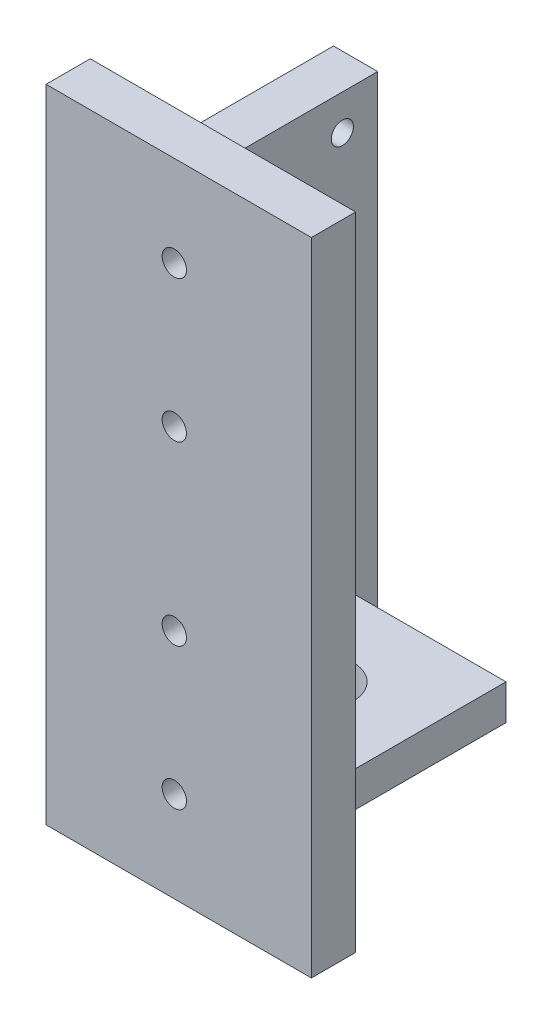
ISO-10303-21;
HEADER;
FILE_DESCRIPTION(('STEP AP214'),'2;1');
FILE_NAME('part.step','',(''),(''),'','','');
FILE_SCHEMA(('AUTOMOTIVE_DESIGN { 1 0 10303 214 1 1 1 1 }'));
ENDSEC;
DATA;
#1=APPLICATION_CONTEXT('core data for automotive mechanical design processes');
#2=APPLICATION_PROTOCOL_DEFINITION('international standard','automotive_design',2000,#1);
#3=PRODUCT_CONTEXT('',#1,'mechanical');
#4=PRODUCT('Part','Part','',(#3));
#5=PRODUCT_RELATED_PRODUCT_CATEGORY('part','',(#4));
#6=PRODUCT_DEFINITION_FORMATION('','',#4);
#7=PRODUCT_DEFINITION_CONTEXT('part definition',#1,'design');
#8=PRODUCT_DEFINITION('design','',#6,#7);
#9=PRODUCT_DEFINITION_SHAPE('','',#8);
#10=(LENGTH_UNIT() NAMED_UNIT(*) SI_UNIT(.MILLI.,.METRE.));
#11=(NAMED_UNIT(*) PLANE_ANGLE_UNIT() SI_UNIT($,.RADIAN.));
#12=(NAMED_UNIT(*) SI_UNIT($,.STERADIAN.) SOLID_ANGLE_UNIT());
#13=UNCERTAINTY_MEASURE_WITH_UNIT(LENGTH_MEASURE(1.E-05),#10,'distance_accuracy_value','');
#14=(GEOMETRIC_REPRESENTATION_CONTEXT(3) GLOBAL_UNCERTAINTY_ASSIGNED_CONTEXT((#13)) GLOBAL_UNIT_ASSIGNED_CONTEXT((#10,
#11,#12)) REPRESENTATION_CONTEXT('',''));
#15=CARTESIAN_POINT('',(0.,0.,0.));
#16=DIRECTION('',(0.,0.,1.));
#17=DIRECTION('',(1.,0.,0.));
#18=AXIS2_PLACEMENT_3D('',#15,#16,#17);
#19=CARTESIAN_POINT('',(-2.,-9.79795897113271,55.));
#20=DIRECTION('',(1.,0.,0.));
#21=DIRECTION('',(0.,0.,-1.));
#22=AXIS2_PLACEMENT_3D('',#19,#20,#21);
#23=PLANE('',#22);
#24=CARTESIAN_POINT('',(-2.,-1.79795897113273,7.99999999999999));
#25=DIRECTION('',(1.,0.,0.));
#26=DIRECTION('',(0.,0.,1.));
#27=AXIS2_PLACEMENT_3D('',#24,#25,#26);
#28=CIRCLE('',#27,2.5);
#29=CARTESIAN_POINT('',(-2.,-1.79795897113273,10.5));
#30=VERTEX_POINT('',#29);
#31=EDGE_CURVE('E289',#30,#30,#28,.T.);
#32=ORIENTED_EDGE('',*,*,#31,.T.);
#33=EDGE_LOOP('',(#32));
#34=FACE_BOUND('',#33,.T.);
#35=CARTESIAN_POINT('',(-2.,-1.79795897113273,47.));
#36=DIRECTION('',(1.,0.,0.));
#37=DIRECTION('',(0.,0.,1.));
#38=AXIS2_PLACEMENT_3D('',#35,#36,#37);
#39=CIRCLE('',#38,2.5);
#40=CARTESIAN_POINT('',(-2.,-1.79795897113273,49.5));
#41=VERTEX_POINT('',#40);
#42=EDGE_CURVE('E293',#41,#41,#39,.T.);
#43=ORIENTED_EDGE('',*,*,#42,.T.);
#44=EDGE_LOOP('',(#43));
#45=FACE_BOUND('',#44,.T.);
#46=CARTESIAN_POINT('',(-2.,102.202041028867,8.));
#47=DIRECTION('',(1.,0.,0.));
#48=DIRECTION('',(0.,0.,-1.));
#49=AXIS2_PLACEMENT_3D('',#46,#47,#48);
#50=CIRCLE('',#49,2.5);
#51=CARTESIAN_POINT('',(-2.,102.202041028867,5.5));
#52=VERTEX_POINT('',#51);
#53=EDGE_CURVE('E297',#52,#52,#50,.T.);
#54=ORIENTED_EDGE('',*,*,#53,.T.);
#55=EDGE_LOOP('',(#54));
#56=FACE_BOUND('',#55,.T.);
#57=CARTESIAN_POINT('',(-2.,102.202041028867,47.));
#58=DIRECTION('',(1.,0.,0.));
#59=DIRECTION('',(0.,0.,-1.));
#60=AXIS2_PLACEMENT_3D('',#57,#58,#59);
#61=CIRCLE('',#60,2.5);
#62=CARTESIAN_POINT('',(-2.,102.202041028867,44.5));
#63=VERTEX_POINT('',#62);
#64=EDGE_CURVE('E301',#63,#63,#61,.T.);
#65=ORIENTED_EDGE('',*,*,#64,.T.);
#66=EDGE_LOOP('',(#65));
#67=FACE_BOUND('',#66,.T.);
#68=DIRECTION('',(0.,-1.,0.));
#69=VECTOR('',#68,1.);
#70=CARTESIAN_POINT('',(-2.,-9.79795897113271,0.));
#71=LINE('',#70,#69);
#72=CARTESIAN_POINT('',(-2.,110.202041028867,0.));
#73=VERTEX_POINT('',#72);
#74=CARTESIAN_POINT('',(-2.,-9.79795897113271,0.));
#75=VERTEX_POINT('',#74);
#76=EDGE_CURVE('E144',#73,#75,#71,.T.);
#77=ORIENTED_EDGE('',*,*,#76,.T.);
#78=DIRECTION('',(0.,0.,-1.));
#79=VECTOR('',#78,1.);
#80=CARTESIAN_POINT('',(-2.,-9.79795897113271,55.));
#81=LINE('',#80,#79);
#82=CARTESIAN_POINT('',(-2.,-9.79795897113271,65.));
#83=VERTEX_POINT('',#82);
#84=EDGE_CURVE('E11',#83,#75,#81,.T.);
#85=ORIENTED_EDGE('',*,*,#84,.F.);
#86=DIRECTION('',(0.,-1.,0.));
#87=VECTOR('',#86,1.);
#88=CARTESIAN_POINT('',(-2.,-9.79795897113271,65.));
#89=LINE('',#88,#87);
#90=CARTESIAN_POINT('',(-2.,135.202041028867,65.));
#91=VERTEX_POINT('',#90);
#92=EDGE_CURVE('E252',#91,#83,#89,.T.);
#93=ORIENTED_EDGE('',*,*,#92,.F.);
#94=DIRECTION('',(0.,0.,-1.));
#95=VECTOR('',#94,1.);
#96=CARTESIAN_POINT('',(-2.,135.202041028867,65.));
#97=LINE('',#96,#95);
#98=CARTESIAN_POINT('',(-2.,135.202041028867,55.));
#99=VERTEX_POINT('',#98);
#100=EDGE_CURVE('E253',#91,#99,#97,.T.);
#101=ORIENTED_EDGE('',*,*,#100,.T.);
#102=DIRECTION('',(0.,-1.,0.));
#103=VECTOR('',#102,1.);
#104=CARTESIAN_POINT('',(-2.,-9.79795897113271,55.));
#105=LINE('',#104,#103);
#106=CARTESIAN_POINT('',(-2.,110.202041028867,55.));
#107=VERTEX_POINT('',#106);
#108=EDGE_CURVE('E235',#99,#107,#105,.T.);
#109=ORIENTED_EDGE('',*,*,#108,.T.);
#110=DIRECTION('',(0.,0.,-1.));
#111=VECTOR('',#110,1.);
#112=CARTESIAN_POINT('',(-2.,110.202041028867,55.));
#113=LINE('',#112,#111);
#114=EDGE_CURVE('E168',#107,#73,#113,.T.);
#115=ORIENTED_EDGE('',*,*,#114,.T.);
#116=EDGE_LOOP('',(#77,#85,#93,#101,#109,#115));
#117=FACE_BOUND('',#116,.T.);
#118=ADVANCED_FACE('F33',(#34,#45,#56,#67,#117),#23,.F.);
#119=CARTESIAN_POINT('',(-2.,-9.79795897113271,55.));
#120=DIRECTION('',(0.,1.,0.));
#121=DIRECTION('',(0.,0.,1.));
#122=AXIS2_PLACEMENT_3D('',#119,#120,#121);
#123=PLANE('',#122);
#124=DIRECTION('',(1.,0.,0.));
#125=VECTOR('',#124,1.);
#126=CARTESIAN_POINT('',(-2.,-9.79795897113271,0.));
#127=LINE('',#126,#125);
#128=CARTESIAN_POINT('',(8.,-9.79795897113271,0.));
#129=VERTEX_POINT('',#128);
#130=EDGE_CURVE('E184',#75,#129,#127,.T.);
#131=ORIENTED_EDGE('',*,*,#130,.T.);
#132=DIRECTION('',(0.,0.,-1.));
#133=VECTOR('',#132,1.);
#134=CARTESIAN_POINT('',(8.,-9.79795897113271,55.));
#135=LINE('',#134,#133);
#136=CARTESIAN_POINT('',(8.,-9.79795897113271,55.));
#137=VERTEX_POINT('',#136);
#138=EDGE_CURVE('E42',#137,#129,#135,.T.);
#139=ORIENTED_EDGE('',*,*,#138,.F.);
#140=DIRECTION('',(1.,0.,0.));
#141=VECTOR('',#140,1.);
#142=CARTESIAN_POINT('',(-2.,-9.79795897113271,55.));
#143=LINE('',#142,#141);
#144=CARTESIAN_POINT('',(58.,-9.79795897113271,55.));
#145=VERTEX_POINT('',#144);
#146=EDGE_CURVE('E229',#137,#145,#143,.T.);
#147=ORIENTED_EDGE('',*,*,#146,.T.);
#148=DIRECTION('',(0.,0.,-1.));
#149=VECTOR('',#148,1.);
#150=CARTESIAN_POINT('',(58.,-9.79795897113271,65.));
#151=LINE('',#150,#149);
#152=CARTESIAN_POINT('',(58.,-9.79795897113271,65.));
#153=VERTEX_POINT('',#152);
#154=EDGE_CURVE('E259',#153,#145,#151,.T.);
#155=ORIENTED_EDGE('',*,*,#154,.F.);
#156=DIRECTION('',(1.,0.,0.));
#157=VECTOR('',#156,1.);
#158=CARTESIAN_POINT('',(-2.,-9.79795897113271,65.));
#159=LINE('',#158,#157);
#160=EDGE_CURVE('E308',#83,#153,#159,.T.);
#161=ORIENTED_EDGE('',*,*,#160,.F.);
#162=ORIENTED_EDGE('',*,*,#84,.T.);
#163=EDGE_LOOP('',(#131,#139,#147,#155,#161,#162));
#164=FACE_BOUND('',#163,.T.);
#165=ADVANCED_FACE('F281',(#164),#123,.F.);
#166=CARTESIAN_POINT('',(8.,-9.79795897113271,55.));
#167=DIRECTION('',(-1.,0.,0.));
#168=DIRECTION('',(0.,0.,1.));
#169=AXIS2_PLACEMENT_3D('',#166,#167,#168);
#170=PLANE('',#169);
#171=CARTESIAN_POINT('',(8.,-1.79795897113273,7.99999999999999));
#172=DIRECTION('',(1.,0.,0.));
#173=DIRECTION('',(0.,0.,1.));
#174=AXIS2_PLACEMENT_3D('',#171,#172,#173);
#175=CIRCLE('',#174,2.5);
#176=CARTESIAN_POINT('',(8.,-1.79795897113273,10.5));
#177=VERTEX_POINT('',#176);
#178=EDGE_CURVE('E485',#177,#177,#175,.T.);
#179=ORIENTED_EDGE('',*,*,#178,.F.);
#180=EDGE_LOOP('',(#179));
#181=FACE_BOUND('',#180,.T.);
#182=CARTESIAN_POINT('',(8.,-1.79795897113273,47.));
#183=DIRECTION('',(1.,0.,0.));
#184=DIRECTION('',(0.,0.,1.));
#185=AXIS2_PLACEMENT_3D('',#182,#183,#184);
#186=CIRCLE('',#185,2.5);
#187=CARTESIAN_POINT('',(8.,-1.79795897113273,49.5));
#188=VERTEX_POINT('',#187);
#189=EDGE_CURVE('E487',#188,#188,#186,.T.);
#190=ORIENTED_EDGE('',*,*,#189,.F.);
#191=EDGE_LOOP('',(#190));
#192=FACE_BOUND('',#191,.T.);
#193=CARTESIAN_POINT('',(8.,102.202041028867,8.));
#194=DIRECTION('',(1.,0.,0.));
#195=DIRECTION('',(0.,0.,-1.));
#196=AXIS2_PLACEMENT_3D('',#193,#194,#195);
#197=CIRCLE('',#196,2.5);
#198=CARTESIAN_POINT('',(8.,102.202041028867,5.5));
#199=VERTEX_POINT('',#198);
#200=EDGE_CURVE('E491',#199,#199,#197,.T.);
#201=ORIENTED_EDGE('',*,*,#200,.F.);
#202=EDGE_LOOP('',(#201));
#203=FACE_BOUND('',#202,.T.);
#204=CARTESIAN_POINT('',(8.,102.202041028867,47.));
#205=DIRECTION('',(1.,0.,0.));
#206=DIRECTION('',(0.,0.,-1.));
#207=AXIS2_PLACEMENT_3D('',#204,#205,#206);
#208=CIRCLE('',#207,2.5);
#209=CARTESIAN_POINT('',(8.,102.202041028867,44.5));
#210=VERTEX_POINT('',#209);
#211=EDGE_CURVE('E495',#210,#210,#208,.T.);
#212=ORIENTED_EDGE('',*,*,#211,.F.);
#213=EDGE_LOOP('',(#212));
#214=FACE_BOUND('',#213,.T.);
#215=DIRECTION('',(0.,1.,0.));
#216=VECTOR('',#215,1.);
#217=CARTESIAN_POINT('',(8.,-9.79795897113271,55.));
#218=LINE('',#217,#216);
#219=CARTESIAN_POINT('',(8.,18.2020410288673,55.));
#220=VERTEX_POINT('',#219);
#221=CARTESIAN_POINT('',(8.,110.202041028867,55.));
#222=VERTEX_POINT('',#221);
#223=EDGE_CURVE('E190',#220,#222,#218,.T.);
#224=ORIENTED_EDGE('',*,*,#223,.F.);
#225=DIRECTION('',(0.,0.,-1.));
#226=VECTOR('',#225,1.);
#227=CARTESIAN_POINT('',(8.,18.2020410288673,55.));
#228=LINE('',#227,#226);
#229=CARTESIAN_POINT('',(8.,18.2020410288673,13.));
#230=VERTEX_POINT('',#229);
#231=EDGE_CURVE('E161',#220,#230,#228,.T.);
#232=ORIENTED_EDGE('',*,*,#231,.T.);
#233=DIRECTION('',(0.,-1.,0.));
#234=VECTOR('',#233,1.);
#235=CARTESIAN_POINT('',(8.,18.2020410288673,13.));
#236=LINE('',#235,#234);
#237=CARTESIAN_POINT('',(8.,10.2020410288673,13.));
#238=VERTEX_POINT('',#237);
#239=EDGE_CURVE('E164',#230,#238,#236,.T.);
#240=ORIENTED_EDGE('',*,*,#239,.T.);
#241=DIRECTION('',(0.,0.,1.));
#242=VECTOR('',#241,1.);
#243=CARTESIAN_POINT('',(8.,10.2020410288673,13.));
#244=LINE('',#243,#242);
#245=CARTESIAN_POINT('',(8.,10.2020410288673,55.));
#246=VERTEX_POINT('',#245);
#247=EDGE_CURVE('E195',#238,#246,#244,.T.);
#248=ORIENTED_EDGE('',*,*,#247,.T.);
#249=EDGE_CURVE('E139',#137,#246,#218,.T.);
#250=ORIENTED_EDGE('',*,*,#249,.F.);
#251=ORIENTED_EDGE('',*,*,#138,.T.);
#252=DIRECTION('',(0.,1.,0.));
#253=VECTOR('',#252,1.);
#254=CARTESIAN_POINT('',(8.,-9.79795897113271,0.));
#255=LINE('',#254,#253);
#256=CARTESIAN_POINT('',(8.,110.202041028867,0.));
#257=VERTEX_POINT('',#256);
#258=EDGE_CURVE('E186',#129,#257,#255,.T.);
#259=ORIENTED_EDGE('',*,*,#258,.T.);
#260=DIRECTION('',(0.,0.,-1.));
#261=VECTOR('',#260,1.);
#262=CARTESIAN_POINT('',(8.,110.202041028867,55.));
#263=LINE('',#262,#261);
#264=EDGE_CURVE('E171',#222,#257,#263,.T.);
#265=ORIENTED_EDGE('',*,*,#264,.F.);
#266=EDGE_LOOP('',(#224,#232,#240,#248,#250,#251,#259,#265));
#267=FACE_BOUND('',#266,.T.);
#268=ADVANCED_FACE('F215',(#181,#192,#203,#214,#267),#170,.F.);
#269=CARTESIAN_POINT('',(-2.,110.202041028867,55.));
#270=DIRECTION('',(0.,-1.,0.));
#271=DIRECTION('',(1.,0.,0.));
#272=AXIS2_PLACEMENT_3D('',#269,#270,#271);
#273=PLANE('',#272);
#274=DIRECTION('',(-1.,0.,0.));
#275=VECTOR('',#274,1.);
#276=CARTESIAN_POINT('',(-2.,110.202041028867,0.));
#277=LINE('',#276,#275);
#278=EDGE_CURVE('E188',#257,#73,#277,.T.);
#279=ORIENTED_EDGE('',*,*,#278,.T.);
#280=ORIENTED_EDGE('',*,*,#114,.F.);
#281=DIRECTION('',(-1.,0.,0.));
#282=VECTOR('',#281,1.);
#283=CARTESIAN_POINT('',(-2.,110.202041028867,55.));
#284=LINE('',#283,#282);
#285=EDGE_CURVE('E172',#222,#107,#284,.T.);
#286=ORIENTED_EDGE('',*,*,#285,.F.);
#287=ORIENTED_EDGE('',*,*,#264,.T.);
#288=EDGE_LOOP('',(#279,#280,#286,#287));
#289=FACE_BOUND('',#288,.T.);
#290=ADVANCED_FACE('F324',(#289),#273,.F.);
#291=CARTESIAN_POINT('',(0.,0.,0.));
#292=DIRECTION('',(0.,0.,-1.));
#293=DIRECTION('',(-1.,0.,0.));
#294=AXIS2_PLACEMENT_3D('',#291,#292,#293);
#295=PLANE('',#294);
#296=ORIENTED_EDGE('',*,*,#76,.F.);
#297=ORIENTED_EDGE('',*,*,#278,.F.);
#298=ORIENTED_EDGE('',*,*,#258,.F.);
#299=ORIENTED_EDGE('',*,*,#130,.F.);
#300=EDGE_LOOP('',(#296,#297,#298,#299));
#301=FACE_BOUND('',#300,.T.);
#302=ADVANCED_FACE('F307',(#301),#295,.T.);
#303=CARTESIAN_POINT('',(50.,10.2020410288673,13.));
#304=DIRECTION('',(0.,-1.,0.));
#305=DIRECTION('',(0.,0.,-1.));
#306=AXIS2_PLACEMENT_3D('',#303,#304,#305);
#307=PLANE('',#306);
#308=CARTESIAN_POINT('',(29.,10.2020410288673,34.));
#309=DIRECTION('',(0.,-1.,0.));
#310=DIRECTION('',(0.,0.,-1.));
#311=AXIS2_PLACEMENT_3D('',#308,#309,#310);
#312=CIRCLE('',#311,7.49999999999999);
#313=CARTESIAN_POINT('',(29.,10.2020410288673,26.5));
#314=VERTEX_POINT('',#313);
#315=EDGE_CURVE('E246',#314,#314,#312,.T.);
#316=ORIENTED_EDGE('',*,*,#315,.F.);
#317=EDGE_LOOP('',(#316));
#318=FACE_BOUND('',#317,.T.);
#319=ORIENTED_EDGE('',*,*,#247,.F.);
#320=DIRECTION('',(-1.,0.,0.));
#321=VECTOR('',#320,1.);
#322=CARTESIAN_POINT('',(50.,10.2020410288673,13.));
#323=LINE('',#322,#321);
#324=CARTESIAN_POINT('',(50.,10.2020410288673,13.));
#325=VERTEX_POINT('',#324);
#326=EDGE_CURVE('E140',#325,#238,#323,.T.);
#327=ORIENTED_EDGE('',*,*,#326,.F.);
#328=DIRECTION('',(0.,0.,1.));
#329=VECTOR('',#328,1.);
#330=CARTESIAN_POINT('',(50.,10.2020410288673,13.));
#331=LINE('',#330,#329);
#332=CARTESIAN_POINT('',(50.,10.2020410288673,55.));
#333=VERTEX_POINT('',#332);
#334=EDGE_CURVE('E158',#325,#333,#331,.T.);
#335=ORIENTED_EDGE('',*,*,#334,.T.);
#336=DIRECTION('',(-1.,0.,0.));
#337=VECTOR('',#336,1.);
#338=CARTESIAN_POINT('',(50.,10.2020410288673,55.));
#339=LINE('',#338,#337);
#340=CARTESIAN_POINT('',(29.7041634567276,10.2020410288673,55.));
#341=VERTEX_POINT('',#340);
#342=EDGE_CURVE('E143',#333,#341,#339,.T.);
#343=ORIENTED_EDGE('',*,*,#342,.T.);
#344=CARTESIAN_POINT('',(24.2958365435317,10.2020410288673,55.));
#345=VERTEX_POINT('',#344);
#346=EDGE_CURVE('E124',#341,#345,#339,.T.);
#347=ORIENTED_EDGE('',*,*,#346,.T.);
#348=EDGE_CURVE('E36',#345,#246,#339,.T.);
#349=ORIENTED_EDGE('',*,*,#348,.T.);
#350=EDGE_LOOP('',(#319,#327,#335,#343,#347,#349));
#351=FACE_BOUND('',#350,.T.);
#352=ADVANCED_FACE('F141',(#318,#351),#307,.T.);
#353=CARTESIAN_POINT('',(50.,18.2020410288673,13.));
#354=DIRECTION('',(0.,0.,-1.));
#355=DIRECTION('',(0.,1.,0.));
#356=AXIS2_PLACEMENT_3D('',#353,#354,#355);
#357=PLANE('',#356);
#358=ORIENTED_EDGE('',*,*,#239,.F.);
#359=DIRECTION('',(-1.,0.,0.));
#360=VECTOR('',#359,1.);
#361=CARTESIAN_POINT('',(50.,18.2020410288673,13.));
#362=LINE('',#361,#360);
#363=CARTESIAN_POINT('',(50.,18.2020410288673,13.));
#364=VERTEX_POINT('',#363);
#365=EDGE_CURVE('E157',#364,#230,#362,.T.);
#366=ORIENTED_EDGE('',*,*,#365,.F.);
#367=DIRECTION('',(0.,-1.,0.));
#368=VECTOR('',#367,1.);
#369=CARTESIAN_POINT('',(50.,18.2020410288673,13.));
#370=LINE('',#369,#368);
#371=EDGE_CURVE('E221',#364,#325,#370,.T.);
#372=ORIENTED_EDGE('',*,*,#371,.T.);
#373=ORIENTED_EDGE('',*,*,#326,.T.);
#374=EDGE_LOOP('',(#358,#366,#372,#373));
#375=FACE_BOUND('',#374,.T.);
#376=ADVANCED_FACE('F213',(#375),#357,.T.);
#377=CARTESIAN_POINT('',(50.,18.2020410288673,55.));
#378=DIRECTION('',(0.,1.,0.));
#379=DIRECTION('',(0.,0.,1.));
#380=AXIS2_PLACEMENT_3D('',#377,#378,#379);
#381=PLANE('',#380);
#382=CARTESIAN_POINT('',(29.,18.2020410288673,34.));
#383=DIRECTION('',(0.,1.,0.));
#384=DIRECTION('',(0.,0.,1.));
#385=AXIS2_PLACEMENT_3D('',#382,#383,#384);
#386=CIRCLE('',#385,7.49999999999999);
#387=CARTESIAN_POINT('',(29.,18.2020410288673,41.5));
#388=VERTEX_POINT('',#387);
#389=EDGE_CURVE('E165',#388,#388,#386,.F.);
#390=ORIENTED_EDGE('',*,*,#389,.T.);
#391=EDGE_LOOP('',(#390));
#392=FACE_BOUND('',#391,.T.);
#393=ORIENTED_EDGE('',*,*,#231,.F.);
#394=DIRECTION('',(-1.,0.,0.));
#395=VECTOR('',#394,1.);
#396=CARTESIAN_POINT('',(50.,18.2020410288673,55.));
#397=LINE('',#396,#395);
#398=CARTESIAN_POINT('',(50.,18.2020410288673,55.));
#399=VERTEX_POINT('',#398);
#400=EDGE_CURVE('E152',#399,#220,#397,.T.);
#401=ORIENTED_EDGE('',*,*,#400,.F.);
#402=DIRECTION('',(0.,0.,-1.));
#403=VECTOR('',#402,1.);
#404=CARTESIAN_POINT('',(50.,18.2020410288673,55.));
#405=LINE('',#404,#403);
#406=EDGE_CURVE('E208',#399,#364,#405,.T.);
#407=ORIENTED_EDGE('',*,*,#406,.T.);
#408=ORIENTED_EDGE('',*,*,#365,.T.);
#409=EDGE_LOOP('',(#393,#401,#407,#408));
#410=FACE_BOUND('',#409,.T.);
#411=ADVANCED_FACE('F205',(#392,#410),#381,.T.);
#412=CARTESIAN_POINT('',(50.,0.,0.));
#413=DIRECTION('',(-1.,0.,0.));
#414=DIRECTION('',(0.,0.,1.));
#415=AXIS2_PLACEMENT_3D('',#412,#413,#414);
#416=PLANE('',#415);
#417=DIRECTION('',(0.,1.,0.));
#418=VECTOR('',#417,1.);
#419=CARTESIAN_POINT('',(50.,10.2020410288673,55.));
#420=LINE('',#419,#418);
#421=EDGE_CURVE('E197',#333,#399,#420,.T.);
#422=ORIENTED_EDGE('',*,*,#421,.F.);
#423=ORIENTED_EDGE('',*,*,#334,.F.);
#424=ORIENTED_EDGE('',*,*,#371,.F.);
#425=ORIENTED_EDGE('',*,*,#406,.F.);
#426=EDGE_LOOP('',(#422,#423,#424,#425));
#427=FACE_BOUND('',#426,.T.);
#428=ADVANCED_FACE('F219',(#427),#416,.F.);
#429=CARTESIAN_POINT('',(29.,39.4152444644637,34.));
#430=DIRECTION('',(0.,-1.,0.));
#431=DIRECTION('',(0.,0.,-1.));
#432=AXIS2_PLACEMENT_3D('',#429,#430,#431);
#433=CYLINDRICAL_SURFACE('',#432,7.49999999999999);
#434=ORIENTED_EDGE('',*,*,#315,.T.);
#435=EDGE_LOOP('',(#434));
#436=FACE_BOUND('',#435,.T.);
#437=ORIENTED_EDGE('',*,*,#389,.F.);
#438=EDGE_LOOP('',(#437));
#439=FACE_BOUND('',#438,.T.);
#440=ADVANCED_FACE('F269',(#436,#439),#433,.F.);
#441=CARTESIAN_POINT('',(58.,-9.79795897113271,65.));
#442=DIRECTION('',(-1.,0.,0.));
#443=DIRECTION('',(0.,0.,1.));
#444=AXIS2_PLACEMENT_3D('',#441,#442,#443);
#445=PLANE('',#444);
#446=DIRECTION('',(0.,1.,0.));
#447=VECTOR('',#446,1.);
#448=CARTESIAN_POINT('',(58.,-9.79795897113271,55.));
#449=LINE('',#448,#447);
#450=CARTESIAN_POINT('',(58.,135.202041028867,55.));
#451=VERTEX_POINT('',#450);
#452=EDGE_CURVE('E231',#145,#451,#449,.T.);
#453=ORIENTED_EDGE('',*,*,#452,.T.);
#454=DIRECTION('',(0.,0.,-1.));
#455=VECTOR('',#454,1.);
#456=CARTESIAN_POINT('',(58.,135.202041028867,65.));
#457=LINE('',#456,#455);
#458=CARTESIAN_POINT('',(58.,135.202041028867,65.));
#459=VERTEX_POINT('',#458);
#460=EDGE_CURVE('E256',#459,#451,#457,.T.);
#461=ORIENTED_EDGE('',*,*,#460,.F.);
#462=DIRECTION('',(0.,1.,0.));
#463=VECTOR('',#462,1.);
#464=CARTESIAN_POINT('',(58.,-9.79795897113271,65.));
#465=LINE('',#464,#463);
#466=EDGE_CURVE('E311',#153,#459,#465,.T.);
#467=ORIENTED_EDGE('',*,*,#466,.F.);
#468=ORIENTED_EDGE('',*,*,#154,.T.);
#469=EDGE_LOOP('',(#453,#461,#467,#468));
#470=FACE_BOUND('',#469,.T.);
#471=ADVANCED_FACE('F271',(#470),#445,.F.);
#472=CARTESIAN_POINT('',(-2.,135.202041028867,65.));
#473=DIRECTION('',(0.,-1.,0.));
#474=DIRECTION('',(0.,0.,-1.));
#475=AXIS2_PLACEMENT_3D('',#472,#473,#474);
#476=PLANE('',#475);
#477=DIRECTION('',(-1.,0.,0.));
#478=VECTOR('',#477,1.);
#479=CARTESIAN_POINT('',(-2.,135.202041028867,55.));
#480=LINE('',#479,#478);
#481=EDGE_CURVE('E237',#451,#99,#480,.T.);
#482=ORIENTED_EDGE('',*,*,#481,.T.);
#483=ORIENTED_EDGE('',*,*,#100,.F.);
#484=DIRECTION('',(-1.,0.,0.));
#485=VECTOR('',#484,1.);
#486=CARTESIAN_POINT('',(-2.,135.202041028867,65.));
#487=LINE('',#486,#485);
#488=EDGE_CURVE('E257',#459,#91,#487,.T.);
#489=ORIENTED_EDGE('',*,*,#488,.F.);
#490=ORIENTED_EDGE('',*,*,#460,.T.);
#491=EDGE_LOOP('',(#482,#483,#489,#490));
#492=FACE_BOUND('',#491,.T.);
#493=ADVANCED_FACE('F277',(#492),#476,.F.);
#494=CARTESIAN_POINT('',(0.,0.,65.));
#495=DIRECTION('',(0.,0.,-1.));
#496=DIRECTION('',(-1.,0.,0.));
#497=AXIS2_PLACEMENT_3D('',#494,#495,#496);
#498=PLANE('',#497);
#499=CARTESIAN_POINT('',(27.0000000001296,10.7020410288673,65.));
#500=DIRECTION('',(0.,0.,1.));
#501=DIRECTION('',(1.,0.,0.));
#502=AXIS2_PLACEMENT_3D('',#499,#500,#501);
#503=CIRCLE('',#502,2.75);
#504=CARTESIAN_POINT('',(29.7500000001296,10.7020410288673,65.));
#505=VERTEX_POINT('',#504);
#506=EDGE_CURVE('E127',#505,#505,#503,.T.);
#507=ORIENTED_EDGE('',*,*,#506,.F.);
#508=EDGE_LOOP('',(#507));
#509=FACE_BOUND('',#508,.T.);
#510=CARTESIAN_POINT('',(27.0000000001296,42.7020410288673,65.));
#511=DIRECTION('',(0.,0.,1.));
#512=DIRECTION('',(1.,0.,0.));
#513=AXIS2_PLACEMENT_3D('',#510,#511,#512);
#514=CIRCLE('',#513,2.75);
#515=CARTESIAN_POINT('',(29.7500000001296,42.7020410288673,65.));
#516=VERTEX_POINT('',#515);
#517=EDGE_CURVE('E133',#516,#516,#514,.T.);
#518=ORIENTED_EDGE('',*,*,#517,.F.);
#519=EDGE_LOOP('',(#518));
#520=FACE_BOUND('',#519,.T.);
#521=CARTESIAN_POINT('',(27.0000000001296,82.7020410288673,65.));
#522=DIRECTION('',(0.,0.,1.));
#523=DIRECTION('',(1.,0.,0.));
#524=AXIS2_PLACEMENT_3D('',#521,#522,#523);
#525=CIRCLE('',#524,2.75);
#526=CARTESIAN_POINT('',(29.7500000001296,82.7020410288673,65.));
#527=VERTEX_POINT('',#526);
#528=EDGE_CURVE('E508',#527,#527,#525,.T.);
#529=ORIENTED_EDGE('',*,*,#528,.F.);
#530=EDGE_LOOP('',(#529));
#531=FACE_BOUND('',#530,.T.);
#532=CARTESIAN_POINT('',(27.0000000001296,114.702041028867,65.));
#533=DIRECTION('',(0.,0.,1.));
#534=DIRECTION('',(1.,0.,0.));
#535=AXIS2_PLACEMENT_3D('',#532,#533,#534);
#536=CIRCLE('',#535,2.75);
#537=CARTESIAN_POINT('',(29.7500000001296,114.702041028867,65.));
#538=VERTEX_POINT('',#537);
#539=EDGE_CURVE('E513',#538,#538,#536,.T.);
#540=ORIENTED_EDGE('',*,*,#539,.F.);
#541=EDGE_LOOP('',(#540));
#542=FACE_BOUND('',#541,.T.);
#543=ORIENTED_EDGE('',*,*,#92,.T.);
#544=ORIENTED_EDGE('',*,*,#160,.T.);
#545=ORIENTED_EDGE('',*,*,#466,.T.);
#546=ORIENTED_EDGE('',*,*,#488,.T.);
#547=EDGE_LOOP('',(#543,#544,#545,#546));
#548=FACE_BOUND('',#547,.T.);
#549=ADVANCED_FACE('F313',(#509,#520,#531,#542,#548),#498,.F.);
#550=CARTESIAN_POINT('',(0.,0.,55.));
#551=DIRECTION('',(0.,0.,-1.));
#552=DIRECTION('',(-1.,0.,0.));
#553=AXIS2_PLACEMENT_3D('',#550,#551,#552);
#554=PLANE('',#553);
#555=CARTESIAN_POINT('',(27.0000000001296,10.7020410288673,55.));
#556=DIRECTION('',(0.,0.,-1.));
#557=DIRECTION('',(-1.,0.,0.));
#558=AXIS2_PLACEMENT_3D('',#555,#556,#557);
#559=CIRCLE('',#558,2.75);
#560=EDGE_CURVE('E126',#345,#341,#559,.F.);
#561=ORIENTED_EDGE('',*,*,#560,.T.);
#562=ORIENTED_EDGE('',*,*,#342,.F.);
#563=ORIENTED_EDGE('',*,*,#421,.T.);
#564=ORIENTED_EDGE('',*,*,#400,.T.);
#565=ORIENTED_EDGE('',*,*,#223,.T.);
#566=ORIENTED_EDGE('',*,*,#285,.T.);
#567=ORIENTED_EDGE('',*,*,#108,.F.);
#568=ORIENTED_EDGE('',*,*,#481,.F.);
#569=ORIENTED_EDGE('',*,*,#452,.F.);
#570=ORIENTED_EDGE('',*,*,#146,.F.);
#571=ORIENTED_EDGE('',*,*,#249,.T.);
#572=ORIENTED_EDGE('',*,*,#348,.F.);
#573=EDGE_LOOP('',(#561,#562,#563,#564,#565,#566,#567,#568,#569,#570,#571,#572));
#574=FACE_BOUND('',#573,.T.);
#575=CARTESIAN_POINT('',(27.0000000001296,42.7020410288673,55.));
#576=DIRECTION('',(0.,0.,-1.));
#577=DIRECTION('',(-1.,0.,0.));
#578=AXIS2_PLACEMENT_3D('',#575,#576,#577);
#579=CIRCLE('',#578,2.75);
#580=CARTESIAN_POINT('',(24.2500000001296,42.7020410288673,55.));
#581=VERTEX_POINT('',#580);
#582=EDGE_CURVE('E505',#581,#581,#579,.F.);
#583=ORIENTED_EDGE('',*,*,#582,.T.);
#584=EDGE_LOOP('',(#583));
#585=FACE_BOUND('',#584,.T.);
#586=CARTESIAN_POINT('',(27.0000000001296,82.7020410288673,55.));
#587=DIRECTION('',(0.,0.,-1.));
#588=DIRECTION('',(-1.,0.,0.));
#589=AXIS2_PLACEMENT_3D('',#586,#587,#588);
#590=CIRCLE('',#589,2.75);
#591=CARTESIAN_POINT('',(24.2500000001296,82.7020410288673,55.));
#592=VERTEX_POINT('',#591);
#593=EDGE_CURVE('E511',#592,#592,#590,.F.);
#594=ORIENTED_EDGE('',*,*,#593,.T.);
#595=EDGE_LOOP('',(#594));
#596=FACE_BOUND('',#595,.T.);
#597=CARTESIAN_POINT('',(27.0000000001296,114.702041028867,55.));
#598=DIRECTION('',(0.,0.,-1.));
#599=DIRECTION('',(-1.,0.,0.));
#600=AXIS2_PLACEMENT_3D('',#597,#598,#599);
#601=CIRCLE('',#600,2.75);
#602=CARTESIAN_POINT('',(24.2500000001296,114.702041028867,55.));
#603=VERTEX_POINT('',#602);
#604=EDGE_CURVE('E240',#603,#603,#601,.F.);
#605=ORIENTED_EDGE('',*,*,#604,.T.);
#606=EDGE_LOOP('',(#605));
#607=FACE_BOUND('',#606,.T.);
#608=ADVANCED_FACE('F135',(#574,#585,#596,#607),#554,.T.);
#609=CARTESIAN_POINT('',(27.0000000001296,114.702041028867,47.221825406948));
#610=DIRECTION('',(0.,0.,1.));
#611=DIRECTION('',(1.,0.,0.));
#612=AXIS2_PLACEMENT_3D('',#609,#610,#611);
#613=CYLINDRICAL_SURFACE('',#612,2.75);
#614=ORIENTED_EDGE('',*,*,#539,.T.);
#615=EDGE_LOOP('',(#614));
#616=FACE_BOUND('',#615,.T.);
#617=ORIENTED_EDGE('',*,*,#604,.F.);
#618=EDGE_LOOP('',(#617));
#619=FACE_BOUND('',#618,.T.);
#620=ADVANCED_FACE('F388',(#616,#619),#613,.F.);
#621=CARTESIAN_POINT('',(27.0000000001296,82.7020410288673,47.221825406948));
#622=DIRECTION('',(0.,0.,1.));
#623=DIRECTION('',(1.,0.,0.));
#624=AXIS2_PLACEMENT_3D('',#621,#622,#623);
#625=CYLINDRICAL_SURFACE('',#624,2.75);
#626=ORIENTED_EDGE('',*,*,#528,.T.);
#627=EDGE_LOOP('',(#626));
#628=FACE_BOUND('',#627,.T.);
#629=ORIENTED_EDGE('',*,*,#593,.F.);
#630=EDGE_LOOP('',(#629));
#631=FACE_BOUND('',#630,.T.);
#632=ADVANCED_FACE('F395',(#628,#631),#625,.F.);
#633=CARTESIAN_POINT('',(27.0000000001296,42.7020410288673,47.221825406948));
#634=DIRECTION('',(0.,0.,1.));
#635=DIRECTION('',(1.,0.,0.));
#636=AXIS2_PLACEMENT_3D('',#633,#634,#635);
#637=CYLINDRICAL_SURFACE('',#636,2.75);
#638=ORIENTED_EDGE('',*,*,#517,.T.);
#639=EDGE_LOOP('',(#638));
#640=FACE_BOUND('',#639,.T.);
#641=ORIENTED_EDGE('',*,*,#582,.F.);
#642=EDGE_LOOP('',(#641));
#643=FACE_BOUND('',#642,.T.);
#644=ADVANCED_FACE('F403',(#640,#643),#637,.F.);
#645=CARTESIAN_POINT('',(0.,0.,55.));
#646=DIRECTION('',(0.,0.,-1.));
#647=DIRECTION('',(-1.,0.,0.));
#648=AXIS2_PLACEMENT_3D('',#645,#646,#647);
#649=PLANE('',#648);
#650=ORIENTED_EDGE('',*,*,#346,.F.);
#651=EDGE_CURVE('E49',#341,#345,#559,.F.);
#652=ORIENTED_EDGE('',*,*,#651,.T.);
#653=EDGE_LOOP('',(#650,#652));
#654=FACE_BOUND('',#653,.T.);
#655=ADVANCED_FACE('F123',(#654),#649,.F.);
#656=CARTESIAN_POINT('',(27.0000000001296,10.7020410288673,47.221825406948));
#657=DIRECTION('',(0.,0.,1.));
#658=DIRECTION('',(1.,0.,0.));
#659=AXIS2_PLACEMENT_3D('',#656,#657,#658);
#660=CYLINDRICAL_SURFACE('',#659,2.75);
#661=ORIENTED_EDGE('',*,*,#506,.T.);
#662=EDGE_LOOP('',(#661));
#663=FACE_BOUND('',#662,.T.);
#664=ORIENTED_EDGE('',*,*,#560,.F.);
#665=ORIENTED_EDGE('',*,*,#651,.F.);
#666=EDGE_LOOP('',(#664,#665));
#667=FACE_BOUND('',#666,.T.);
#668=ADVANCED_FACE('F129',(#663,#667),#660,.F.);
#669=CARTESIAN_POINT('',(-2.,102.202041028867,47.));
#670=DIRECTION('',(1.,0.,0.));
#671=DIRECTION('',(0.,0.,-1.));
#672=AXIS2_PLACEMENT_3D('',#669,#670,#671);
#673=CYLINDRICAL_SURFACE('',#672,2.5);
#674=ORIENTED_EDGE('',*,*,#64,.F.);
#675=EDGE_LOOP('',(#674));
#676=FACE_BOUND('',#675,.T.);
#677=ORIENTED_EDGE('',*,*,#211,.T.);
#678=EDGE_LOOP('',(#677));
#679=FACE_BOUND('',#678,.T.);
#680=ADVANCED_FACE('F424',(#676,#679),#673,.F.);
#681=CARTESIAN_POINT('',(-2.,102.202041028867,8.));
#682=DIRECTION('',(1.,0.,0.));
#683=DIRECTION('',(0.,0.,-1.));
#684=AXIS2_PLACEMENT_3D('',#681,#682,#683);
#685=CYLINDRICAL_SURFACE('',#684,2.5);
#686=ORIENTED_EDGE('',*,*,#53,.F.);
#687=EDGE_LOOP('',(#686));
#688=FACE_BOUND('',#687,.T.);
#689=ORIENTED_EDGE('',*,*,#200,.T.);
#690=EDGE_LOOP('',(#689));
#691=FACE_BOUND('',#690,.T.);
#692=ADVANCED_FACE('F432',(#688,#691),#685,.F.);
#693=CARTESIAN_POINT('',(-2.,-1.79795897113273,47.));
#694=DIRECTION('',(1.,0.,0.));
#695=DIRECTION('',(0.,0.,-1.));
#696=AXIS2_PLACEMENT_3D('',#693,#694,#695);
#697=CYLINDRICAL_SURFACE('',#696,2.5);
#698=ORIENTED_EDGE('',*,*,#42,.F.);
#699=EDGE_LOOP('',(#698));
#700=FACE_BOUND('',#699,.T.);
#701=ORIENTED_EDGE('',*,*,#189,.T.);
#702=EDGE_LOOP('',(#701));
#703=FACE_BOUND('',#702,.T.);
#704=ADVANCED_FACE('F441',(#700,#703),#697,.F.);
#705=CARTESIAN_POINT('',(-2.,-1.79795897113273,7.99999999999999));
#706=DIRECTION('',(1.,0.,0.));
#707=DIRECTION('',(0.,0.,-1.));
#708=AXIS2_PLACEMENT_3D('',#705,#706,#707);
#709=CYLINDRICAL_SURFACE('',#708,2.5);
#710=ORIENTED_EDGE('',*,*,#31,.F.);
#711=EDGE_LOOP('',(#710));
#712=FACE_BOUND('',#711,.T.);
#713=ORIENTED_EDGE('',*,*,#178,.T.);
#714=EDGE_LOOP('',(#713));
#715=FACE_BOUND('',#714,.T.);
#716=ADVANCED_FACE('F449',(#712,#715),#709,.F.);
#717=CLOSED_SHELL('',(#118,#165,#268,#290,#302,#352,#376,#411,#428,#440,#471,#493,#549,#608,
#620,#632,#644,#655,#668,#680,#692,#704,#716));
#718=MANIFOLD_SOLID_BREP('B2',#717);
#719=ADVANCED_BREP_SHAPE_REPRESENTATION('',(#18,#718),#14);
#720=SHAPE_DEFINITION_REPRESENTATION(#9,#719);
ENDSEC;
END-ISO-10303-21;
